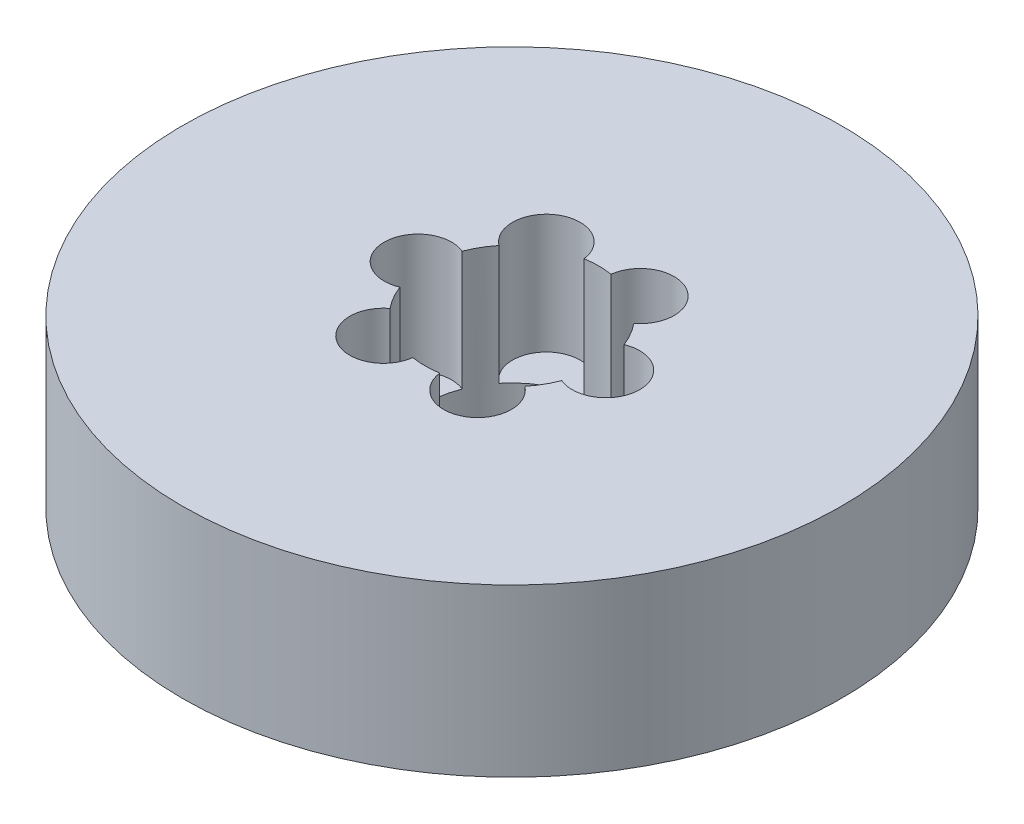
ISO-10303-21;
HEADER;
FILE_DESCRIPTION(('STEP AP214'),'2;1');
FILE_NAME('part.step','',(''),(''),'','','');
FILE_SCHEMA(('AUTOMOTIVE_DESIGN { 1 0 10303 214 1 1 1 1 }'));
ENDSEC;
DATA;
#1=APPLICATION_CONTEXT('core data for automotive mechanical design processes');
#2=APPLICATION_PROTOCOL_DEFINITION('international standard','automotive_design',2000,#1);
#3=PRODUCT_CONTEXT('',#1,'mechanical');
#4=PRODUCT('Part','Part','',(#3));
#5=PRODUCT_RELATED_PRODUCT_CATEGORY('part','',(#4));
#6=PRODUCT_DEFINITION_FORMATION('','',#4);
#7=PRODUCT_DEFINITION_CONTEXT('part definition',#1,'design');
#8=PRODUCT_DEFINITION('design','',#6,#7);
#9=PRODUCT_DEFINITION_SHAPE('','',#8);
#10=(LENGTH_UNIT() NAMED_UNIT(*) SI_UNIT(.MILLI.,.METRE.));
#11=(NAMED_UNIT(*) PLANE_ANGLE_UNIT() SI_UNIT($,.RADIAN.));
#12=(NAMED_UNIT(*) SI_UNIT($,.STERADIAN.) SOLID_ANGLE_UNIT());
#13=UNCERTAINTY_MEASURE_WITH_UNIT(LENGTH_MEASURE(1.E-05),#10,'distance_accuracy_value','');
#14=(GEOMETRIC_REPRESENTATION_CONTEXT(3) GLOBAL_UNCERTAINTY_ASSIGNED_CONTEXT((#13)) GLOBAL_UNIT_ASSIGNED_CONTEXT((#10,
#11,#12)) REPRESENTATION_CONTEXT('',''));
#15=CARTESIAN_POINT('',(0.,0.,0.));
#16=DIRECTION('',(0.,0.,1.));
#17=DIRECTION('',(1.,0.,0.));
#18=AXIS2_PLACEMENT_3D('',#15,#16,#17);
#19=CARTESIAN_POINT('',(0.,24.,0.));
#20=DIRECTION('',(0.,-1.,0.));
#21=DIRECTION('',(0.,0.,-1.));
#22=AXIS2_PLACEMENT_3D('',#19,#20,#21);
#23=CYLINDRICAL_SURFACE('',#22,47.5);
#24=CARTESIAN_POINT('',(0.,24.,0.));
#25=DIRECTION('',(0.,1.,0.));
#26=DIRECTION('',(0.,0.,1.));
#27=AXIS2_PLACEMENT_3D('',#24,#25,#26);
#28=CIRCLE('',#27,47.5);
#29=CARTESIAN_POINT('',(0.,24.,47.5));
#30=VERTEX_POINT('',#29);
#31=EDGE_CURVE('E171',#30,#30,#28,.T.);
#32=ORIENTED_EDGE('',*,*,#31,.F.);
#33=EDGE_LOOP('',(#32));
#34=FACE_BOUND('',#33,.T.);
#35=CARTESIAN_POINT('',(0.,0.,0.));
#36=DIRECTION('',(0.,1.,0.));
#37=DIRECTION('',(0.,0.,1.));
#38=AXIS2_PLACEMENT_3D('',#35,#36,#37);
#39=CIRCLE('',#38,47.5);
#40=CARTESIAN_POINT('',(0.,0.,47.5));
#41=VERTEX_POINT('',#40);
#42=EDGE_CURVE('E157',#41,#41,#39,.T.);
#43=ORIENTED_EDGE('',*,*,#42,.T.);
#44=EDGE_LOOP('',(#43));
#45=FACE_BOUND('',#44,.T.);
#46=ADVANCED_FACE('F39',(#34,#45),#23,.T.);
#47=CARTESIAN_POINT('',(0.,24.,0.));
#48=DIRECTION('',(0.,1.,0.));
#49=DIRECTION('',(0.,0.,1.));
#50=AXIS2_PLACEMENT_3D('',#47,#48,#49);
#51=PLANE('',#50);
#52=CARTESIAN_POINT('',(-6.77341442767753,24.,-11.7318979294572));
#53=DIRECTION('',(0.,1.,0.));
#54=DIRECTION('',(-0.866025403784433,0.,0.50000000000001));
#55=AXIS2_PLACEMENT_3D('',#52,#53,#54);
#56=CIRCLE('',#55,4.87207621017849);
#57=CARTESIAN_POINT('',(-1.94050850171824,24.,-12.348458476861));
#58=VERTEX_POINT('',#57);
#59=CARTESIAN_POINT('',(-9.72382448767995,24.,-7.85475889717793));
#60=VERTEX_POINT('',#59);
#61=EDGE_CURVE('E214',#58,#60,#56,.T.);
#62=ORIENTED_EDGE('',*,*,#61,.F.);
#63=CARTESIAN_POINT('',(0.,24.,0.));
#64=DIRECTION('',(0.,1.,0.));
#65=DIRECTION('',(0.,0.,1.));
#66=AXIS2_PLACEMENT_3D('',#63,#64,#65);
#67=CIRCLE('',#66,12.5);
#68=CARTESIAN_POINT('',(1.94050850171798,24.,-12.348458476861));
#69=VERTEX_POINT('',#68);
#70=EDGE_CURVE('E272',#69,#58,#67,.T.);
#71=ORIENTED_EDGE('',*,*,#70,.F.);
#72=CARTESIAN_POINT('',(6.77341442767729,24.,-11.7318979294574));
#73=DIRECTION('',(0.,1.,0.));
#74=DIRECTION('',(-0.866025403784443,0.,-0.499999999999992));
#75=AXIS2_PLACEMENT_3D('',#72,#73,#74);
#76=CIRCLE('',#75,4.87207621017849);
#77=CARTESIAN_POINT('',(9.72382448767979,24.,-7.85475889717813));
#78=VERTEX_POINT('',#77);
#79=EDGE_CURVE('E285',#78,#69,#76,.T.);
#80=ORIENTED_EDGE('',*,*,#79,.F.);
#81=CARTESIAN_POINT('',(11.664332989398,24.,-4.49369957968294));
#82=VERTEX_POINT('',#81);
#83=EDGE_CURVE('E165',#82,#78,#67,.T.);
#84=ORIENTED_EDGE('',*,*,#83,.F.);
#85=CARTESIAN_POINT('',(13.5468288553548,24.,0.));
#86=DIRECTION('',(0.,1.,0.));
#87=DIRECTION('',(0.,0.,-1.));
#88=AXIS2_PLACEMENT_3D('',#85,#86,#87);
#89=CIRCLE('',#88,4.87207621017849);
#90=CARTESIAN_POINT('',(11.664332989398,24.,4.49369957968294));
#91=VERTEX_POINT('',#90);
#92=EDGE_CURVE('E281',#91,#82,#89,.T.);
#93=ORIENTED_EDGE('',*,*,#92,.F.);
#94=CARTESIAN_POINT('',(9.72382448767989,24.,7.854758897178));
#95=VERTEX_POINT('',#94);
#96=EDGE_CURVE('E160',#95,#91,#67,.T.);
#97=ORIENTED_EDGE('',*,*,#96,.F.);
#98=CARTESIAN_POINT('',(6.77341442767745,24.,11.7318979294573));
#99=DIRECTION('',(0.,1.,0.));
#100=DIRECTION('',(0.866025403784436,0.,-0.500000000000004));
#101=AXIS2_PLACEMENT_3D('',#98,#99,#100);
#102=CIRCLE('',#101,4.87207621017849);
#103=CARTESIAN_POINT('',(1.94050850171816,24.,12.348458476861));
#104=VERTEX_POINT('',#103);
#105=EDGE_CURVE('E154',#104,#95,#102,.T.);
#106=ORIENTED_EDGE('',*,*,#105,.F.);
#107=CARTESIAN_POINT('',(-1.94050850171807,24.,12.348458476861));
#108=VERTEX_POINT('',#107);
#109=EDGE_CURVE('E150',#108,#104,#67,.T.);
#110=ORIENTED_EDGE('',*,*,#109,.F.);
#111=CARTESIAN_POINT('',(-6.77341442767737,24.,11.7318979294573));
#112=DIRECTION('',(0.,1.,0.));
#113=DIRECTION('',(0.86602540378444,0.,0.499999999999998));
#114=AXIS2_PLACEMENT_3D('',#111,#112,#113);
#115=CIRCLE('',#114,4.87207621017849);
#116=CARTESIAN_POINT('',(-9.72382448767984,24.,7.85475889717807));
#117=VERTEX_POINT('',#116);
#118=EDGE_CURVE('E127',#117,#108,#115,.T.);
#119=ORIENTED_EDGE('',*,*,#118,.F.);
#120=CARTESIAN_POINT('',(-11.664332989398,24.,4.49369957968294));
#121=VERTEX_POINT('',#120);
#122=EDGE_CURVE('E156',#121,#117,#67,.T.);
#123=ORIENTED_EDGE('',*,*,#122,.F.);
#124=CARTESIAN_POINT('',(-13.5468288553548,24.,0.));
#125=DIRECTION('',(0.,1.,0.));
#126=DIRECTION('',(0.,0.,1.));
#127=AXIS2_PLACEMENT_3D('',#124,#125,#126);
#128=CIRCLE('',#127,4.87207621017849);
#129=CARTESIAN_POINT('',(-11.664332989398,24.,-4.49369957968294));
#130=VERTEX_POINT('',#129);
#131=EDGE_CURVE('E164',#130,#121,#128,.T.);
#132=ORIENTED_EDGE('',*,*,#131,.F.);
#133=EDGE_CURVE('E159',#60,#130,#67,.T.);
#134=ORIENTED_EDGE('',*,*,#133,.F.);
#135=EDGE_LOOP('',(#62,#71,#80,#84,#93,#97,#106,#110,#119,#123,#132,#134));
#136=FACE_BOUND('',#135,.T.);
#137=ORIENTED_EDGE('',*,*,#31,.T.);
#138=EDGE_LOOP('',(#137));
#139=FACE_BOUND('',#138,.T.);
#140=ADVANCED_FACE('F155',(#136,#139),#51,.T.);
#141=CARTESIAN_POINT('',(0.,0.,0.));
#142=DIRECTION('',(0.,1.,0.));
#143=DIRECTION('',(0.,0.,1.));
#144=AXIS2_PLACEMENT_3D('',#141,#142,#143);
#145=PLANE('',#144);
#146=CARTESIAN_POINT('',(0.,0.,0.));
#147=DIRECTION('',(0.,1.,0.));
#148=DIRECTION('',(0.,0.,1.));
#149=AXIS2_PLACEMENT_3D('',#146,#147,#148);
#150=CIRCLE('',#149,12.5);
#151=CARTESIAN_POINT('',(0.,0.,12.5));
#152=VERTEX_POINT('',#151);
#153=EDGE_CURVE('E170',#152,#152,#150,.T.);
#154=ORIENTED_EDGE('',*,*,#153,.T.);
#155=EDGE_LOOP('',(#154));
#156=FACE_BOUND('',#155,.T.);
#157=ORIENTED_EDGE('',*,*,#42,.F.);
#158=EDGE_LOOP('',(#157));
#159=FACE_BOUND('',#158,.T.);
#160=ADVANCED_FACE('F232',(#156,#159),#145,.F.);
#161=CARTESIAN_POINT('',(0.,24.,0.));
#162=DIRECTION('',(0.,-1.,0.));
#163=DIRECTION('',(0.,0.,-1.));
#164=AXIS2_PLACEMENT_3D('',#161,#162,#163);
#165=CYLINDRICAL_SURFACE('',#164,12.5);
#166=DIRECTION('',(0.,1.,0.));
#167=VECTOR('',#166,1.);
#168=CARTESIAN_POINT('',(-1.94050850171824,15.3977681433979,-12.348458476861));
#169=LINE('',#168,#167);
#170=CARTESIAN_POINT('',(-1.94050850171824,6.79553628679584,-12.348458476861));
#171=VERTEX_POINT('',#170);
#172=EDGE_CURVE('E11',#171,#58,#169,.T.);
#173=ORIENTED_EDGE('',*,*,#172,.F.);
#174=CARTESIAN_POINT('',(0.,6.79553628679584,0.));
#175=DIRECTION('',(0.,1.,0.));
#176=DIRECTION('',(0.,0.,1.));
#177=AXIS2_PLACEMENT_3D('',#174,#175,#176);
#178=CIRCLE('',#177,12.5);
#179=CARTESIAN_POINT('',(-9.72382448767995,6.79553628679584,-7.85475889717793));
#180=VERTEX_POINT('',#179);
#181=EDGE_CURVE('E209',#171,#180,#178,.T.);
#182=ORIENTED_EDGE('',*,*,#181,.T.);
#183=DIRECTION('',(0.,1.,0.));
#184=VECTOR('',#183,1.);
#185=CARTESIAN_POINT('',(-9.72382448767995,15.3977681433979,-7.85475889717793));
#186=LINE('',#185,#184);
#187=EDGE_CURVE('E46',#60,#180,#186,.F.);
#188=ORIENTED_EDGE('',*,*,#187,.F.);
#189=ORIENTED_EDGE('',*,*,#133,.T.);
#190=DIRECTION('',(0.,1.,0.));
#191=VECTOR('',#190,1.);
#192=CARTESIAN_POINT('',(-11.664332989398,15.3977681433979,-4.49369957968294));
#193=LINE('',#192,#191);
#194=CARTESIAN_POINT('',(-11.664332989398,6.79553628679584,-4.49369957968294));
#195=VERTEX_POINT('',#194);
#196=EDGE_CURVE('E185',#195,#130,#193,.T.);
#197=ORIENTED_EDGE('',*,*,#196,.F.);
#198=CARTESIAN_POINT('',(0.,6.79553628679584,0.));
#199=DIRECTION('',(0.,1.,0.));
#200=DIRECTION('',(0.,0.,1.));
#201=AXIS2_PLACEMENT_3D('',#198,#199,#200);
#202=CIRCLE('',#201,12.5);
#203=CARTESIAN_POINT('',(-11.664332989398,6.79553628679584,4.49369957968294));
#204=VERTEX_POINT('',#203);
#205=EDGE_CURVE('E173',#195,#204,#202,.T.);
#206=ORIENTED_EDGE('',*,*,#205,.T.);
#207=DIRECTION('',(0.,1.,0.));
#208=VECTOR('',#207,1.);
#209=CARTESIAN_POINT('',(-11.664332989398,15.3977681433979,4.49369957968294));
#210=LINE('',#209,#208);
#211=EDGE_CURVE('E178',#121,#204,#210,.F.);
#212=ORIENTED_EDGE('',*,*,#211,.F.);
#213=ORIENTED_EDGE('',*,*,#122,.T.);
#214=DIRECTION('',(0.,1.,0.));
#215=VECTOR('',#214,1.);
#216=CARTESIAN_POINT('',(-9.72382448767984,15.3977681433979,7.85475889717806));
#217=LINE('',#216,#215);
#218=CARTESIAN_POINT('',(-9.72382448767984,6.79553628679584,7.85475889717807));
#219=VERTEX_POINT('',#218);
#220=EDGE_CURVE('E132',#219,#117,#217,.T.);
#221=ORIENTED_EDGE('',*,*,#220,.F.);
#222=CARTESIAN_POINT('',(0.,6.79553628679584,0.));
#223=DIRECTION('',(0.,1.,0.));
#224=DIRECTION('',(0.,0.,1.));
#225=AXIS2_PLACEMENT_3D('',#222,#223,#224);
#226=CIRCLE('',#225,12.5);
#227=CARTESIAN_POINT('',(-1.94050850171807,6.79553628679584,12.348458476861));
#228=VERTEX_POINT('',#227);
#229=EDGE_CURVE('E146',#219,#228,#226,.T.);
#230=ORIENTED_EDGE('',*,*,#229,.T.);
#231=DIRECTION('',(0.,1.,0.));
#232=VECTOR('',#231,1.);
#233=CARTESIAN_POINT('',(-1.94050850171807,15.3977681433979,12.348458476861));
#234=LINE('',#233,#232);
#235=EDGE_CURVE('E128',#108,#228,#234,.F.);
#236=ORIENTED_EDGE('',*,*,#235,.F.);
#237=ORIENTED_EDGE('',*,*,#109,.T.);
#238=DIRECTION('',(0.,1.,0.));
#239=VECTOR('',#238,1.);
#240=CARTESIAN_POINT('',(1.94050850171816,15.3977681433979,12.348458476861));
#241=LINE('',#240,#239);
#242=CARTESIAN_POINT('',(1.94050850171816,6.79553628679584,12.348458476861));
#243=VERTEX_POINT('',#242);
#244=EDGE_CURVE('E192',#243,#104,#241,.T.);
#245=ORIENTED_EDGE('',*,*,#244,.F.);
#246=CARTESIAN_POINT('',(0.,6.79553628679584,0.));
#247=DIRECTION('',(0.,1.,0.));
#248=DIRECTION('',(0.,0.,1.));
#249=AXIS2_PLACEMENT_3D('',#246,#247,#248);
#250=CIRCLE('',#249,12.5);
#251=CARTESIAN_POINT('',(9.72382448767989,6.79553628679584,7.854758897178));
#252=VERTEX_POINT('',#251);
#253=EDGE_CURVE('E190',#243,#252,#250,.T.);
#254=ORIENTED_EDGE('',*,*,#253,.T.);
#255=DIRECTION('',(0.,1.,0.));
#256=VECTOR('',#255,1.);
#257=CARTESIAN_POINT('',(9.72382448767989,15.3977681433979,7.854758897178));
#258=LINE('',#257,#256);
#259=EDGE_CURVE('E189',#95,#252,#258,.F.);
#260=ORIENTED_EDGE('',*,*,#259,.F.);
#261=ORIENTED_EDGE('',*,*,#96,.T.);
#262=DIRECTION('',(0.,1.,0.));
#263=VECTOR('',#262,1.);
#264=CARTESIAN_POINT('',(11.664332989398,15.3977681433979,4.49369957968294));
#265=LINE('',#264,#263);
#266=CARTESIAN_POINT('',(11.664332989398,6.79553628679584,4.49369957968294));
#267=VERTEX_POINT('',#266);
#268=EDGE_CURVE('E203',#267,#91,#265,.T.);
#269=ORIENTED_EDGE('',*,*,#268,.F.);
#270=CARTESIAN_POINT('',(0.,6.79553628679584,0.));
#271=DIRECTION('',(0.,1.,0.));
#272=DIRECTION('',(0.,0.,1.));
#273=AXIS2_PLACEMENT_3D('',#270,#271,#272);
#274=CIRCLE('',#273,12.5);
#275=CARTESIAN_POINT('',(11.664332989398,6.79553628679584,-4.49369957968294));
#276=VERTEX_POINT('',#275);
#277=EDGE_CURVE('E194',#267,#276,#274,.T.);
#278=ORIENTED_EDGE('',*,*,#277,.T.);
#279=DIRECTION('',(0.,1.,0.));
#280=VECTOR('',#279,1.);
#281=CARTESIAN_POINT('',(11.664332989398,15.3977681433979,-4.49369957968294));
#282=LINE('',#281,#280);
#283=EDGE_CURVE('E196',#82,#276,#282,.F.);
#284=ORIENTED_EDGE('',*,*,#283,.F.);
#285=ORIENTED_EDGE('',*,*,#83,.T.);
#286=DIRECTION('',(0.,1.,0.));
#287=VECTOR('',#286,1.);
#288=CARTESIAN_POINT('',(9.72382448767979,15.3977681433979,-7.85475889717813));
#289=LINE('',#288,#287);
#290=CARTESIAN_POINT('',(9.72382448767979,6.79553628679584,-7.85475889717813));
#291=VERTEX_POINT('',#290);
#292=EDGE_CURVE('E208',#291,#78,#289,.T.);
#293=ORIENTED_EDGE('',*,*,#292,.F.);
#294=CARTESIAN_POINT('',(0.,6.79553628679584,0.));
#295=DIRECTION('',(0.,1.,0.));
#296=DIRECTION('',(0.,0.,1.));
#297=AXIS2_PLACEMENT_3D('',#294,#295,#296);
#298=CIRCLE('',#297,12.5);
#299=CARTESIAN_POINT('',(1.94050850171798,6.79553628679584,-12.348458476861));
#300=VERTEX_POINT('',#299);
#301=EDGE_CURVE('E201',#291,#300,#298,.T.);
#302=ORIENTED_EDGE('',*,*,#301,.T.);
#303=DIRECTION('',(0.,1.,0.));
#304=VECTOR('',#303,1.);
#305=CARTESIAN_POINT('',(1.94050850171798,15.3977681433979,-12.348458476861));
#306=LINE('',#305,#304);
#307=EDGE_CURVE('E206',#69,#300,#306,.F.);
#308=ORIENTED_EDGE('',*,*,#307,.F.);
#309=ORIENTED_EDGE('',*,*,#70,.T.);
#310=EDGE_LOOP('',(#173,#182,#188,#189,#197,#206,#212,#213,#221,#230,#236,#237,#245,#254,#260,
#261,#269,#278,#284,#285,#293,#302,#308,#309));
#311=FACE_BOUND('',#310,.T.);
#312=ORIENTED_EDGE('',*,*,#153,.F.);
#313=EDGE_LOOP('',(#312));
#314=FACE_BOUND('',#313,.T.);
#315=ADVANCED_FACE('F145',(#311,#314),#165,.F.);
#316=CARTESIAN_POINT('',(-13.5468288553548,6.79553628679584,0.));
#317=DIRECTION('',(0.,1.,0.));
#318=DIRECTION('',(0.,0.,1.));
#319=AXIS2_PLACEMENT_3D('',#316,#317,#318);
#320=CYLINDRICAL_SURFACE('',#319,4.87207621017849);
#321=ORIENTED_EDGE('',*,*,#196,.T.);
#322=ORIENTED_EDGE('',*,*,#131,.T.);
#323=ORIENTED_EDGE('',*,*,#211,.T.);
#324=CARTESIAN_POINT('',(-13.5468288553548,6.79553628679584,0.));
#325=DIRECTION('',(0.,1.,0.));
#326=DIRECTION('',(0.,0.,1.));
#327=AXIS2_PLACEMENT_3D('',#324,#325,#326);
#328=CIRCLE('',#327,4.87207621017849);
#329=EDGE_CURVE('E168',#195,#204,#328,.T.);
#330=ORIENTED_EDGE('',*,*,#329,.F.);
#331=EDGE_LOOP('',(#321,#322,#323,#330));
#332=FACE_BOUND('',#331,.T.);
#333=ADVANCED_FACE('F243',(#332),#320,.F.);
#334=CARTESIAN_POINT('',(-13.5468288553548,6.79553628679584,0.));
#335=DIRECTION('',(0.,1.,0.));
#336=DIRECTION('',(0.,0.,1.));
#337=AXIS2_PLACEMENT_3D('',#334,#335,#336);
#338=PLANE('',#337);
#339=ORIENTED_EDGE('',*,*,#329,.T.);
#340=ORIENTED_EDGE('',*,*,#205,.F.);
#341=EDGE_LOOP('',(#339,#340));
#342=FACE_BOUND('',#341,.T.);
#343=ADVANCED_FACE('F247',(#342),#338,.T.);
#344=CARTESIAN_POINT('',(-6.77341442767737,6.79553628679584,11.7318979294573));
#345=DIRECTION('',(0.,1.,0.));
#346=DIRECTION('',(0.,0.,1.));
#347=AXIS2_PLACEMENT_3D('',#344,#345,#346);
#348=CYLINDRICAL_SURFACE('',#347,4.87207621017849);
#349=ORIENTED_EDGE('',*,*,#220,.T.);
#350=ORIENTED_EDGE('',*,*,#118,.T.);
#351=ORIENTED_EDGE('',*,*,#235,.T.);
#352=CARTESIAN_POINT('',(-6.77341442767737,6.79553628679584,11.7318979294573));
#353=DIRECTION('',(0.,1.,0.));
#354=DIRECTION('',(0.86602540378444,0.,0.499999999999998));
#355=AXIS2_PLACEMENT_3D('',#352,#353,#354);
#356=CIRCLE('',#355,4.87207621017849);
#357=EDGE_CURVE('E137',#219,#228,#356,.T.);
#358=ORIENTED_EDGE('',*,*,#357,.F.);
#359=EDGE_LOOP('',(#349,#350,#351,#358));
#360=FACE_BOUND('',#359,.T.);
#361=ADVANCED_FACE('F126',(#360),#348,.F.);
#362=CARTESIAN_POINT('',(-6.77341442767737,6.79553628679584,11.7318979294573));
#363=DIRECTION('',(0.,1.,0.));
#364=DIRECTION('',(0.86602540378444,0.,0.499999999999998));
#365=AXIS2_PLACEMENT_3D('',#362,#363,#364);
#366=PLANE('',#365);
#367=ORIENTED_EDGE('',*,*,#357,.T.);
#368=ORIENTED_EDGE('',*,*,#229,.F.);
#369=EDGE_LOOP('',(#367,#368));
#370=FACE_BOUND('',#369,.T.);
#371=ADVANCED_FACE('F254',(#370),#366,.T.);
#372=CARTESIAN_POINT('',(6.77341442767745,6.79553628679584,11.7318979294573));
#373=DIRECTION('',(0.,1.,0.));
#374=DIRECTION('',(0.,0.,1.));
#375=AXIS2_PLACEMENT_3D('',#372,#373,#374);
#376=CYLINDRICAL_SURFACE('',#375,4.87207621017849);
#377=ORIENTED_EDGE('',*,*,#244,.T.);
#378=ORIENTED_EDGE('',*,*,#105,.T.);
#379=ORIENTED_EDGE('',*,*,#259,.T.);
#380=CARTESIAN_POINT('',(6.77341442767745,6.79553628679584,11.7318979294573));
#381=DIRECTION('',(0.,1.,0.));
#382=DIRECTION('',(0.866025403784436,0.,-0.500000000000004));
#383=AXIS2_PLACEMENT_3D('',#380,#381,#382);
#384=CIRCLE('',#383,4.87207621017849);
#385=EDGE_CURVE('E138',#243,#252,#384,.T.);
#386=ORIENTED_EDGE('',*,*,#385,.F.);
#387=EDGE_LOOP('',(#377,#378,#379,#386));
#388=FACE_BOUND('',#387,.T.);
#389=ADVANCED_FACE('F260',(#388),#376,.F.);
#390=CARTESIAN_POINT('',(6.77341442767745,6.79553628679584,11.7318979294573));
#391=DIRECTION('',(0.,1.,0.));
#392=DIRECTION('',(0.866025403784436,0.,-0.500000000000004));
#393=AXIS2_PLACEMENT_3D('',#390,#391,#392);
#394=PLANE('',#393);
#395=ORIENTED_EDGE('',*,*,#385,.T.);
#396=ORIENTED_EDGE('',*,*,#253,.F.);
#397=EDGE_LOOP('',(#395,#396));
#398=FACE_BOUND('',#397,.T.);
#399=ADVANCED_FACE('F265',(#398),#394,.T.);
#400=CARTESIAN_POINT('',(13.5468288553548,6.79553628679584,0.));
#401=DIRECTION('',(0.,1.,0.));
#402=DIRECTION('',(0.,0.,1.));
#403=AXIS2_PLACEMENT_3D('',#400,#401,#402);
#404=CYLINDRICAL_SURFACE('',#403,4.87207621017849);
#405=ORIENTED_EDGE('',*,*,#268,.T.);
#406=ORIENTED_EDGE('',*,*,#92,.T.);
#407=ORIENTED_EDGE('',*,*,#283,.T.);
#408=CARTESIAN_POINT('',(13.5468288553548,6.79553628679584,0.));
#409=DIRECTION('',(0.,1.,0.));
#410=DIRECTION('',(0.,0.,-1.));
#411=AXIS2_PLACEMENT_3D('',#408,#409,#410);
#412=CIRCLE('',#411,4.87207621017849);
#413=EDGE_CURVE('E287',#267,#276,#412,.T.);
#414=ORIENTED_EDGE('',*,*,#413,.F.);
#415=EDGE_LOOP('',(#405,#406,#407,#414));
#416=FACE_BOUND('',#415,.T.);
#417=ADVANCED_FACE('F300',(#416),#404,.F.);
#418=CARTESIAN_POINT('',(13.5468288553548,6.79553628679584,0.));
#419=DIRECTION('',(0.,1.,0.));
#420=DIRECTION('',(0.,0.,-1.));
#421=AXIS2_PLACEMENT_3D('',#418,#419,#420);
#422=PLANE('',#421);
#423=ORIENTED_EDGE('',*,*,#413,.T.);
#424=ORIENTED_EDGE('',*,*,#277,.F.);
#425=EDGE_LOOP('',(#423,#424));
#426=FACE_BOUND('',#425,.T.);
#427=ADVANCED_FACE('F298',(#426),#422,.T.);
#428=CARTESIAN_POINT('',(6.77341442767729,6.79553628679584,-11.7318979294574));
#429=DIRECTION('',(0.,1.,0.));
#430=DIRECTION('',(0.,0.,1.));
#431=AXIS2_PLACEMENT_3D('',#428,#429,#430);
#432=CYLINDRICAL_SURFACE('',#431,4.87207621017849);
#433=ORIENTED_EDGE('',*,*,#292,.T.);
#434=ORIENTED_EDGE('',*,*,#79,.T.);
#435=ORIENTED_EDGE('',*,*,#307,.T.);
#436=CARTESIAN_POINT('',(6.77341442767729,6.79553628679584,-11.7318979294574));
#437=DIRECTION('',(0.,1.,0.));
#438=DIRECTION('',(-0.866025403784443,0.,-0.499999999999992));
#439=AXIS2_PLACEMENT_3D('',#436,#437,#438);
#440=CIRCLE('',#439,4.87207621017849);
#441=EDGE_CURVE('E56',#291,#300,#440,.T.);
#442=ORIENTED_EDGE('',*,*,#441,.F.);
#443=EDGE_LOOP('',(#433,#434,#435,#442));
#444=FACE_BOUND('',#443,.T.);
#445=ADVANCED_FACE('F301',(#444),#432,.F.);
#446=CARTESIAN_POINT('',(6.77341442767729,6.79553628679584,-11.7318979294574));
#447=DIRECTION('',(0.,1.,0.));
#448=DIRECTION('',(-0.866025403784443,0.,-0.499999999999992));
#449=AXIS2_PLACEMENT_3D('',#446,#447,#448);
#450=PLANE('',#449);
#451=ORIENTED_EDGE('',*,*,#441,.T.);
#452=ORIENTED_EDGE('',*,*,#301,.F.);
#453=EDGE_LOOP('',(#451,#452));
#454=FACE_BOUND('',#453,.T.);
#455=ADVANCED_FACE('F221',(#454),#450,.T.);
#456=CARTESIAN_POINT('',(-6.77341442767753,6.79553628679584,-11.7318979294572));
#457=DIRECTION('',(0.,1.,0.));
#458=DIRECTION('',(0.,0.,1.));
#459=AXIS2_PLACEMENT_3D('',#456,#457,#458);
#460=CYLINDRICAL_SURFACE('',#459,4.87207621017849);
#461=ORIENTED_EDGE('',*,*,#172,.T.);
#462=ORIENTED_EDGE('',*,*,#61,.T.);
#463=ORIENTED_EDGE('',*,*,#187,.T.);
#464=CARTESIAN_POINT('',(-6.77341442767753,6.79553628679584,-11.7318979294572));
#465=DIRECTION('',(0.,1.,0.));
#466=DIRECTION('',(-0.866025403784433,0.,0.50000000000001));
#467=AXIS2_PLACEMENT_3D('',#464,#465,#466);
#468=CIRCLE('',#467,4.87207621017849);
#469=EDGE_CURVE('E55',#171,#180,#468,.T.);
#470=ORIENTED_EDGE('',*,*,#469,.F.);
#471=EDGE_LOOP('',(#461,#462,#463,#470));
#472=FACE_BOUND('',#471,.T.);
#473=ADVANCED_FACE('F212',(#472),#460,.F.);
#474=CARTESIAN_POINT('',(-6.77341442767753,6.79553628679584,-11.7318979294572));
#475=DIRECTION('',(0.,1.,0.));
#476=DIRECTION('',(-0.866025403784433,0.,0.50000000000001));
#477=AXIS2_PLACEMENT_3D('',#474,#475,#476);
#478=PLANE('',#477);
#479=ORIENTED_EDGE('',*,*,#469,.T.);
#480=ORIENTED_EDGE('',*,*,#181,.F.);
#481=EDGE_LOOP('',(#479,#480));
#482=FACE_BOUND('',#481,.T.);
#483=ADVANCED_FACE('F217',(#482),#478,.T.);
#484=CLOSED_SHELL('',(#46,#140,#160,#315,#333,#343,#361,#371,#389,#399,#417,#427,#445,#455,#473,#483));
#485=MANIFOLD_SOLID_BREP('B2',#484);
#486=ADVANCED_BREP_SHAPE_REPRESENTATION('',(#18,#485),#14);
#487=SHAPE_DEFINITION_REPRESENTATION(#9,#486);
ENDSEC;
END-ISO-10303-21;
